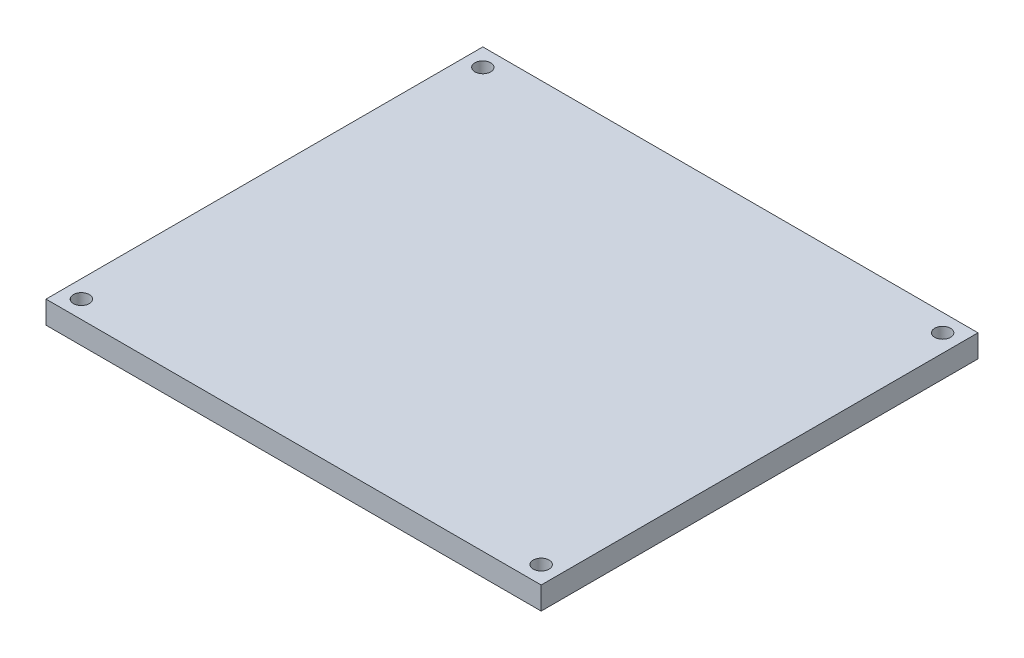
ISO-10303-21;
HEADER;
FILE_DESCRIPTION(('STEP AP214'),'2;1');
FILE_NAME('part.step','',(''),(''),'','','');
FILE_SCHEMA(('AUTOMOTIVE_DESIGN { 1 0 10303 214 1 1 1 1 }'));
ENDSEC;
DATA;
#1=APPLICATION_CONTEXT('core data for automotive mechanical design processes');
#2=APPLICATION_PROTOCOL_DEFINITION('international standard','automotive_design',2000,#1);
#3=PRODUCT_CONTEXT('',#1,'mechanical');
#4=PRODUCT('Part','Part','',(#3));
#5=PRODUCT_RELATED_PRODUCT_CATEGORY('part','',(#4));
#6=PRODUCT_DEFINITION_FORMATION('','',#4);
#7=PRODUCT_DEFINITION_CONTEXT('part definition',#1,'design');
#8=PRODUCT_DEFINITION('design','',#6,#7);
#9=PRODUCT_DEFINITION_SHAPE('','',#8);
#10=(LENGTH_UNIT() NAMED_UNIT(*) SI_UNIT(.MILLI.,.METRE.));
#11=(NAMED_UNIT(*) PLANE_ANGLE_UNIT() SI_UNIT($,.RADIAN.));
#12=(NAMED_UNIT(*) SI_UNIT($,.STERADIAN.) SOLID_ANGLE_UNIT());
#13=UNCERTAINTY_MEASURE_WITH_UNIT(LENGTH_MEASURE(1.E-05),#10,'distance_accuracy_value','');
#14=(GEOMETRIC_REPRESENTATION_CONTEXT(3) GLOBAL_UNCERTAINTY_ASSIGNED_CONTEXT((#13)) GLOBAL_UNIT_ASSIGNED_CONTEXT((#10,
#11,#12)) REPRESENTATION_CONTEXT('',''));
#15=CARTESIAN_POINT('',(0.,0.,0.));
#16=DIRECTION('',(0.,0.,1.));
#17=DIRECTION('',(1.,0.,0.));
#18=AXIS2_PLACEMENT_3D('',#15,#16,#17);
#19=CARTESIAN_POINT('',(0.,5.,0.));
#20=DIRECTION('',(1.,0.,0.));
#21=DIRECTION('',(0.,0.,-1.));
#22=AXIS2_PLACEMENT_3D('',#19,#20,#21);
#23=PLANE('',#22);
#24=DIRECTION('',(0.,0.,1.));
#25=VECTOR('',#24,1.);
#26=CARTESIAN_POINT('',(0.,0.,0.));
#27=LINE('',#26,#25);
#28=CARTESIAN_POINT('',(0.,0.,-96.55));
#29=VERTEX_POINT('',#28);
#30=CARTESIAN_POINT('',(0.,0.,0.));
#31=VERTEX_POINT('',#30);
#32=EDGE_CURVE('E96',#29,#31,#27,.T.);
#33=ORIENTED_EDGE('',*,*,#32,.T.);
#34=DIRECTION('',(0.,-1.,0.));
#35=VECTOR('',#34,1.);
#36=CARTESIAN_POINT('',(0.,5.,0.));
#37=LINE('',#36,#35);
#38=CARTESIAN_POINT('',(0.,5.,0.));
#39=VERTEX_POINT('',#38);
#40=EDGE_CURVE('E11',#39,#31,#37,.T.);
#41=ORIENTED_EDGE('',*,*,#40,.F.);
#42=DIRECTION('',(0.,0.,1.));
#43=VECTOR('',#42,1.);
#44=CARTESIAN_POINT('',(0.,5.,0.));
#45=LINE('',#44,#43);
#46=CARTESIAN_POINT('',(0.,5.,-96.55));
#47=VERTEX_POINT('',#46);
#48=EDGE_CURVE('E84',#47,#39,#45,.T.);
#49=ORIENTED_EDGE('',*,*,#48,.F.);
#50=DIRECTION('',(0.,-1.,0.));
#51=VECTOR('',#50,1.);
#52=CARTESIAN_POINT('',(0.,5.,-96.55));
#53=LINE('',#52,#51);
#54=EDGE_CURVE('E92',#47,#29,#53,.T.);
#55=ORIENTED_EDGE('',*,*,#54,.T.);
#56=EDGE_LOOP('',(#33,#41,#49,#55));
#57=FACE_BOUND('',#56,.T.);
#58=ADVANCED_FACE('F33',(#57),#23,.F.);
#59=CARTESIAN_POINT('',(0.,5.,0.));
#60=DIRECTION('',(0.,0.,-1.));
#61=DIRECTION('',(-1.,0.,0.));
#62=AXIS2_PLACEMENT_3D('',#59,#60,#61);
#63=PLANE('',#62);
#64=DIRECTION('',(1.,0.,0.));
#65=VECTOR('',#64,1.);
#66=CARTESIAN_POINT('',(0.,0.,0.));
#67=LINE('',#66,#65);
#68=CARTESIAN_POINT('',(109.45,0.,0.));
#69=VERTEX_POINT('',#68);
#70=EDGE_CURVE('E88',#31,#69,#67,.T.);
#71=ORIENTED_EDGE('',*,*,#70,.T.);
#72=DIRECTION('',(0.,-1.,0.));
#73=VECTOR('',#72,1.);
#74=CARTESIAN_POINT('',(109.45,5.,0.));
#75=LINE('',#74,#73);
#76=CARTESIAN_POINT('',(109.45,5.,0.));
#77=VERTEX_POINT('',#76);
#78=EDGE_CURVE('E41',#77,#69,#75,.T.);
#79=ORIENTED_EDGE('',*,*,#78,.F.);
#80=DIRECTION('',(1.,0.,0.));
#81=VECTOR('',#80,1.);
#82=CARTESIAN_POINT('',(0.,5.,0.));
#83=LINE('',#82,#81);
#84=EDGE_CURVE('E79',#39,#77,#83,.T.);
#85=ORIENTED_EDGE('',*,*,#84,.F.);
#86=ORIENTED_EDGE('',*,*,#40,.T.);
#87=EDGE_LOOP('',(#71,#79,#85,#86));
#88=FACE_BOUND('',#87,.T.);
#89=ADVANCED_FACE('F87',(#88),#63,.F.);
#90=CARTESIAN_POINT('',(109.45,5.,0.));
#91=DIRECTION('',(-1.,0.,0.));
#92=DIRECTION('',(0.,0.,1.));
#93=AXIS2_PLACEMENT_3D('',#90,#91,#92);
#94=PLANE('',#93);
#95=DIRECTION('',(0.,0.,-1.));
#96=VECTOR('',#95,1.);
#97=CARTESIAN_POINT('',(109.45,0.,0.));
#98=LINE('',#97,#96);
#99=CARTESIAN_POINT('',(109.45,0.,-96.55));
#100=VERTEX_POINT('',#99);
#101=EDGE_CURVE('E66',#69,#100,#98,.T.);
#102=ORIENTED_EDGE('',*,*,#101,.T.);
#103=DIRECTION('',(0.,-1.,0.));
#104=VECTOR('',#103,1.);
#105=CARTESIAN_POINT('',(109.45,5.,-96.55));
#106=LINE('',#105,#104);
#107=CARTESIAN_POINT('',(109.45,5.,-96.55));
#108=VERTEX_POINT('',#107);
#109=EDGE_CURVE('E89',#108,#100,#106,.T.);
#110=ORIENTED_EDGE('',*,*,#109,.F.);
#111=DIRECTION('',(0.,0.,-1.));
#112=VECTOR('',#111,1.);
#113=CARTESIAN_POINT('',(109.45,5.,0.));
#114=LINE('',#113,#112);
#115=EDGE_CURVE('E82',#77,#108,#114,.T.);
#116=ORIENTED_EDGE('',*,*,#115,.F.);
#117=ORIENTED_EDGE('',*,*,#78,.T.);
#118=EDGE_LOOP('',(#102,#110,#116,#117));
#119=FACE_BOUND('',#118,.T.);
#120=ADVANCED_FACE('F90',(#119),#94,.F.);
#121=CARTESIAN_POINT('',(0.,5.,-96.55));
#122=DIRECTION('',(0.,0.,1.));
#123=DIRECTION('',(1.,0.,0.));
#124=AXIS2_PLACEMENT_3D('',#121,#122,#123);
#125=PLANE('',#124);
#126=DIRECTION('',(-1.,0.,0.));
#127=VECTOR('',#126,1.);
#128=CARTESIAN_POINT('',(0.,0.,-96.55));
#129=LINE('',#128,#127);
#130=EDGE_CURVE('E72',#100,#29,#129,.T.);
#131=ORIENTED_EDGE('',*,*,#130,.T.);
#132=ORIENTED_EDGE('',*,*,#54,.F.);
#133=DIRECTION('',(-1.,0.,0.));
#134=VECTOR('',#133,1.);
#135=CARTESIAN_POINT('',(0.,5.,-96.55));
#136=LINE('',#135,#134);
#137=EDGE_CURVE('E49',#108,#47,#136,.T.);
#138=ORIENTED_EDGE('',*,*,#137,.F.);
#139=ORIENTED_EDGE('',*,*,#109,.T.);
#140=EDGE_LOOP('',(#131,#132,#138,#139));
#141=FACE_BOUND('',#140,.T.);
#142=ADVANCED_FACE('F104',(#141),#125,.F.);
#143=CARTESIAN_POINT('',(0.,5.,0.));
#144=DIRECTION('',(0.,-1.,0.));
#145=DIRECTION('',(0.,0.,-1.));
#146=AXIS2_PLACEMENT_3D('',#143,#144,#145);
#147=PLANE('',#146);
#148=CARTESIAN_POINT('',(105.54,5.,-92.64));
#149=DIRECTION('',(0.,1.,0.));
#150=DIRECTION('',(0.,0.,-1.));
#151=AXIS2_PLACEMENT_3D('',#148,#149,#150);
#152=CIRCLE('',#151,1.74999999999998);
#153=CARTESIAN_POINT('',(105.54,5.,-94.39));
#154=VERTEX_POINT('',#153);
#155=EDGE_CURVE('E128',#154,#154,#152,.T.);
#156=ORIENTED_EDGE('',*,*,#155,.F.);
#157=EDGE_LOOP('',(#156));
#158=FACE_BOUND('',#157,.T.);
#159=CARTESIAN_POINT('',(105.54,5.,-3.90999999999997));
#160=DIRECTION('',(0.,1.,0.));
#161=DIRECTION('',(0.,0.,1.));
#162=AXIS2_PLACEMENT_3D('',#159,#160,#161);
#163=CIRCLE('',#162,1.75000000000001);
#164=CARTESIAN_POINT('',(105.54,5.,-2.15999999999996));
#165=VERTEX_POINT('',#164);
#166=EDGE_CURVE('E122',#165,#165,#163,.T.);
#167=ORIENTED_EDGE('',*,*,#166,.F.);
#168=EDGE_LOOP('',(#167));
#169=FACE_BOUND('',#168,.T.);
#170=CARTESIAN_POINT('',(3.91,5.,-3.91));
#171=DIRECTION('',(0.,1.,0.));
#172=DIRECTION('',(0.,0.,-1.));
#173=AXIS2_PLACEMENT_3D('',#170,#171,#172);
#174=CIRCLE('',#173,1.75);
#175=CARTESIAN_POINT('',(3.91,5.,-5.66));
#176=VERTEX_POINT('',#175);
#177=EDGE_CURVE('E116',#176,#176,#174,.T.);
#178=ORIENTED_EDGE('',*,*,#177,.F.);
#179=EDGE_LOOP('',(#178));
#180=FACE_BOUND('',#179,.T.);
#181=CARTESIAN_POINT('',(3.91,5.,-92.64));
#182=DIRECTION('',(0.,1.,0.));
#183=DIRECTION('',(0.,0.,1.));
#184=AXIS2_PLACEMENT_3D('',#181,#182,#183);
#185=CIRCLE('',#184,1.75);
#186=CARTESIAN_POINT('',(3.91,5.,-90.89));
#187=VERTEX_POINT('',#186);
#188=EDGE_CURVE('E110',#187,#187,#185,.T.);
#189=ORIENTED_EDGE('',*,*,#188,.F.);
#190=EDGE_LOOP('',(#189));
#191=FACE_BOUND('',#190,.T.);
#192=ORIENTED_EDGE('',*,*,#48,.T.);
#193=ORIENTED_EDGE('',*,*,#84,.T.);
#194=ORIENTED_EDGE('',*,*,#115,.T.);
#195=ORIENTED_EDGE('',*,*,#137,.T.);
#196=EDGE_LOOP('',(#192,#193,#194,#195));
#197=FACE_BOUND('',#196,.T.);
#198=ADVANCED_FACE('F80',(#158,#169,#180,#191,#197),#147,.F.);
#199=CARTESIAN_POINT('',(0.,0.,0.));
#200=DIRECTION('',(0.,-1.,0.));
#201=DIRECTION('',(0.,0.,-1.));
#202=AXIS2_PLACEMENT_3D('',#199,#200,#201);
#203=PLANE('',#202);
#204=CARTESIAN_POINT('',(105.54,0.,-92.64));
#205=DIRECTION('',(0.,1.,0.));
#206=DIRECTION('',(0.,0.,-1.));
#207=AXIS2_PLACEMENT_3D('',#204,#205,#206);
#208=CIRCLE('',#207,1.74999999999998);
#209=CARTESIAN_POINT('',(105.54,0.,-94.39));
#210=VERTEX_POINT('',#209);
#211=EDGE_CURVE('E125',#210,#210,#208,.T.);
#212=ORIENTED_EDGE('',*,*,#211,.T.);
#213=EDGE_LOOP('',(#212));
#214=FACE_BOUND('',#213,.T.);
#215=CARTESIAN_POINT('',(105.54,0.,-3.90999999999997));
#216=DIRECTION('',(0.,1.,0.));
#217=DIRECTION('',(0.,0.,1.));
#218=AXIS2_PLACEMENT_3D('',#215,#216,#217);
#219=CIRCLE('',#218,1.75000000000001);
#220=CARTESIAN_POINT('',(105.54,0.,-2.15999999999996));
#221=VERTEX_POINT('',#220);
#222=EDGE_CURVE('E119',#221,#221,#219,.T.);
#223=ORIENTED_EDGE('',*,*,#222,.T.);
#224=EDGE_LOOP('',(#223));
#225=FACE_BOUND('',#224,.T.);
#226=CARTESIAN_POINT('',(3.91,0.,-3.91));
#227=DIRECTION('',(0.,1.,0.));
#228=DIRECTION('',(0.,0.,-1.));
#229=AXIS2_PLACEMENT_3D('',#226,#227,#228);
#230=CIRCLE('',#229,1.75);
#231=CARTESIAN_POINT('',(3.91,0.,-5.66));
#232=VERTEX_POINT('',#231);
#233=EDGE_CURVE('E113',#232,#232,#230,.T.);
#234=ORIENTED_EDGE('',*,*,#233,.T.);
#235=EDGE_LOOP('',(#234));
#236=FACE_BOUND('',#235,.T.);
#237=CARTESIAN_POINT('',(3.91,0.,-92.64));
#238=DIRECTION('',(0.,1.,0.));
#239=DIRECTION('',(0.,0.,1.));
#240=AXIS2_PLACEMENT_3D('',#237,#238,#239);
#241=CIRCLE('',#240,1.75);
#242=CARTESIAN_POINT('',(3.91,0.,-90.89));
#243=VERTEX_POINT('',#242);
#244=EDGE_CURVE('E99',#243,#243,#241,.T.);
#245=ORIENTED_EDGE('',*,*,#244,.T.);
#246=EDGE_LOOP('',(#245));
#247=FACE_BOUND('',#246,.T.);
#248=ORIENTED_EDGE('',*,*,#32,.F.);
#249=ORIENTED_EDGE('',*,*,#130,.F.);
#250=ORIENTED_EDGE('',*,*,#101,.F.);
#251=ORIENTED_EDGE('',*,*,#70,.F.);
#252=EDGE_LOOP('',(#248,#249,#250,#251));
#253=FACE_BOUND('',#252,.T.);
#254=ADVANCED_FACE('F107',(#214,#225,#236,#247,#253),#203,.T.);
#255=CARTESIAN_POINT('',(3.91,0.,-92.64));
#256=DIRECTION('',(0.,1.,0.));
#257=DIRECTION('',(0.,0.,1.));
#258=AXIS2_PLACEMENT_3D('',#255,#256,#257);
#259=CYLINDRICAL_SURFACE('',#258,1.75);
#260=ORIENTED_EDGE('',*,*,#244,.F.);
#261=EDGE_LOOP('',(#260));
#262=FACE_BOUND('',#261,.T.);
#263=ORIENTED_EDGE('',*,*,#188,.T.);
#264=EDGE_LOOP('',(#263));
#265=FACE_BOUND('',#264,.T.);
#266=ADVANCED_FACE('F152',(#262,#265),#259,.F.);
#267=CARTESIAN_POINT('',(3.91,0.,-3.91));
#268=DIRECTION('',(0.,1.,0.));
#269=DIRECTION('',(0.,0.,1.));
#270=AXIS2_PLACEMENT_3D('',#267,#268,#269);
#271=CYLINDRICAL_SURFACE('',#270,1.75);
#272=ORIENTED_EDGE('',*,*,#233,.F.);
#273=EDGE_LOOP('',(#272));
#274=FACE_BOUND('',#273,.T.);
#275=ORIENTED_EDGE('',*,*,#177,.T.);
#276=EDGE_LOOP('',(#275));
#277=FACE_BOUND('',#276,.T.);
#278=ADVANCED_FACE('F154',(#274,#277),#271,.F.);
#279=CARTESIAN_POINT('',(105.54,0.,-3.90999999999997));
#280=DIRECTION('',(0.,1.,0.));
#281=DIRECTION('',(0.,0.,1.));
#282=AXIS2_PLACEMENT_3D('',#279,#280,#281);
#283=CYLINDRICAL_SURFACE('',#282,1.75000000000001);
#284=ORIENTED_EDGE('',*,*,#222,.F.);
#285=EDGE_LOOP('',(#284));
#286=FACE_BOUND('',#285,.T.);
#287=ORIENTED_EDGE('',*,*,#166,.T.);
#288=EDGE_LOOP('',(#287));
#289=FACE_BOUND('',#288,.T.);
#290=ADVANCED_FACE('F139',(#286,#289),#283,.F.);
#291=CARTESIAN_POINT('',(105.54,0.,-92.64));
#292=DIRECTION('',(0.,1.,0.));
#293=DIRECTION('',(0.,0.,1.));
#294=AXIS2_PLACEMENT_3D('',#291,#292,#293);
#295=CYLINDRICAL_SURFACE('',#294,1.74999999999998);
#296=ORIENTED_EDGE('',*,*,#211,.F.);
#297=EDGE_LOOP('',(#296));
#298=FACE_BOUND('',#297,.T.);
#299=ORIENTED_EDGE('',*,*,#155,.T.);
#300=EDGE_LOOP('',(#299));
#301=FACE_BOUND('',#300,.T.);
#302=ADVANCED_FACE('F136',(#298,#301),#295,.F.);
#303=CLOSED_SHELL('',(#58,#89,#120,#142,#198,#254,#266,#278,#290,#302));
#304=MANIFOLD_SOLID_BREP('B2',#303);
#305=ADVANCED_BREP_SHAPE_REPRESENTATION('',(#18,#304),#14);
#306=SHAPE_DEFINITION_REPRESENTATION(#9,#305);
ENDSEC;
END-ISO-10303-21;
